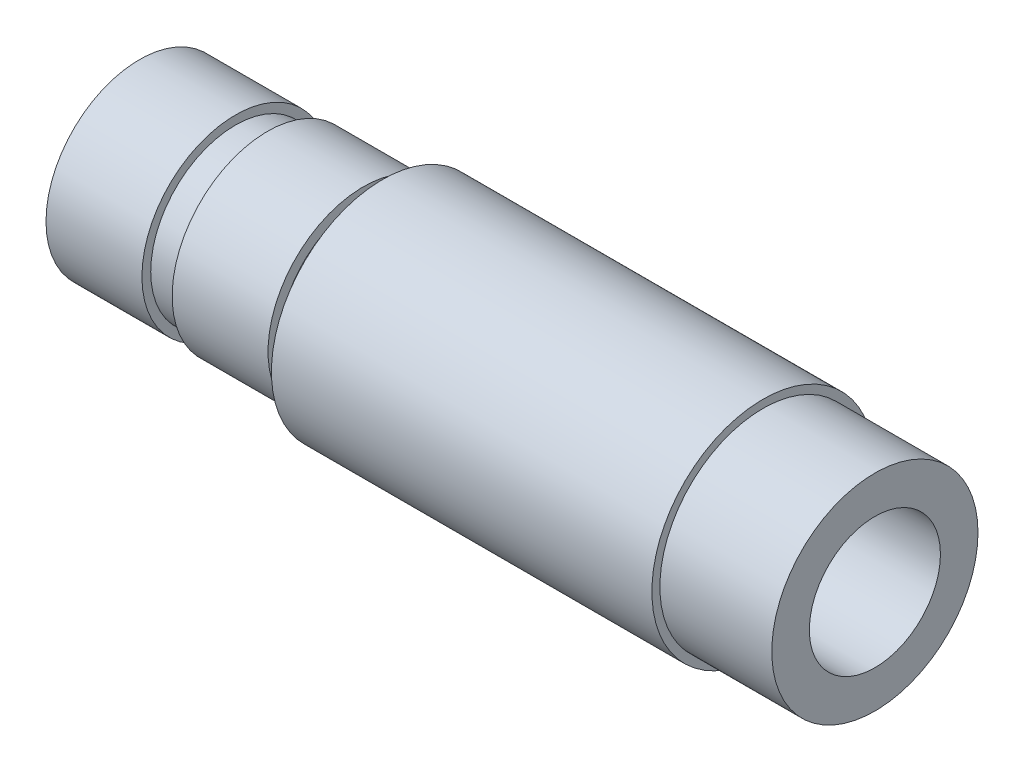
ISO-10303-21;
HEADER;
FILE_DESCRIPTION(('STEP AP214'),'2;1');
FILE_NAME('part.step','',(''),(''),'','','');
FILE_SCHEMA(('AUTOMOTIVE_DESIGN { 1 0 10303 214 1 1 1 1 }'));
ENDSEC;
DATA;
#1=APPLICATION_CONTEXT('core data for automotive mechanical design processes');
#2=APPLICATION_PROTOCOL_DEFINITION('international standard','automotive_design',2000,#1);
#3=PRODUCT_CONTEXT('',#1,'mechanical');
#4=PRODUCT('Part','Part','',(#3));
#5=PRODUCT_RELATED_PRODUCT_CATEGORY('part','',(#4));
#6=PRODUCT_DEFINITION_FORMATION('','',#4);
#7=PRODUCT_DEFINITION_CONTEXT('part definition',#1,'design');
#8=PRODUCT_DEFINITION('design','',#6,#7);
#9=PRODUCT_DEFINITION_SHAPE('','',#8);
#10=(LENGTH_UNIT() NAMED_UNIT(*) SI_UNIT(.MILLI.,.METRE.));
#11=(NAMED_UNIT(*) PLANE_ANGLE_UNIT() SI_UNIT($,.RADIAN.));
#12=(NAMED_UNIT(*) SI_UNIT($,.STERADIAN.) SOLID_ANGLE_UNIT());
#13=UNCERTAINTY_MEASURE_WITH_UNIT(LENGTH_MEASURE(1.E-05),#10,'distance_accuracy_value','');
#14=(GEOMETRIC_REPRESENTATION_CONTEXT(3) GLOBAL_UNCERTAINTY_ASSIGNED_CONTEXT((#13)) GLOBAL_UNIT_ASSIGNED_CONTEXT((#10,
#11,#12)) REPRESENTATION_CONTEXT('',''));
#15=CARTESIAN_POINT('',(0.,0.,0.));
#16=DIRECTION('',(0.,0.,1.));
#17=DIRECTION('',(1.,0.,0.));
#18=AXIS2_PLACEMENT_3D('',#15,#16,#17);
#19=CARTESIAN_POINT('',(284.762244726479,0.,0.));
#20=DIRECTION('',(1.,0.,0.));
#21=DIRECTION('',(0.,0.,-1.));
#22=AXIS2_PLACEMENT_3D('',#19,#20,#21);
#23=PLANE('',#22);
#24=CARTESIAN_POINT('',(284.762244726479,76.8438535300278,0.));
#25=DIRECTION('',(-1.,0.,0.));
#26=DIRECTION('',(0.,0.,1.));
#27=AXIS2_PLACEMENT_3D('',#24,#25,#26);
#28=CIRCLE('',#27,1.75);
#29=CARTESIAN_POINT('',(284.762244726479,76.8438535300278,1.75));
#30=VERTEX_POINT('',#29);
#31=EDGE_CURVE('E82',#30,#30,#28,.T.);
#32=ORIENTED_EDGE('',*,*,#31,.F.);
#33=EDGE_LOOP('',(#32));
#34=FACE_BOUND('',#33,.T.);
#35=CARTESIAN_POINT('',(284.762244726479,76.8438535300278,0.));
#36=DIRECTION('',(1.,0.,0.));
#37=DIRECTION('',(0.,0.,-1.));
#38=AXIS2_PLACEMENT_3D('',#35,#36,#37);
#39=CIRCLE('',#38,2.925);
#40=CARTESIAN_POINT('',(284.762244726479,76.8438535300278,-2.925));
#41=VERTEX_POINT('',#40);
#42=EDGE_CURVE('E64',#41,#41,#39,.T.);
#43=ORIENTED_EDGE('',*,*,#42,.F.);
#44=EDGE_LOOP('',(#43));
#45=FACE_BOUND('',#44,.T.);
#46=ADVANCED_FACE('F32',(#34,#45),#23,.F.);
#47=CARTESIAN_POINT('',(307.762244726479,76.8438535300278,0.));
#48=DIRECTION('',(1.,0.,0.));
#49=DIRECTION('',(0.,0.,-1.));
#50=AXIS2_PLACEMENT_3D('',#47,#48,#49);
#51=CYLINDRICAL_SURFACE('',#50,2.925);
#52=CARTESIAN_POINT('',(287.762244726479,76.8438535300278,0.));
#53=DIRECTION('',(1.,0.,0.));
#54=DIRECTION('',(0.,0.,-1.));
#55=AXIS2_PLACEMENT_3D('',#52,#53,#54);
#56=CIRCLE('',#55,2.925);
#57=CARTESIAN_POINT('',(287.762244726479,76.8438535300278,-2.925));
#58=VERTEX_POINT('',#57);
#59=EDGE_CURVE('E61',#58,#58,#56,.T.);
#60=ORIENTED_EDGE('',*,*,#59,.F.);
#61=EDGE_LOOP('',(#60));
#62=FACE_BOUND('',#61,.T.);
#63=ORIENTED_EDGE('',*,*,#42,.T.);
#64=EDGE_LOOP('',(#63));
#65=FACE_BOUND('',#64,.T.);
#66=ADVANCED_FACE('F122',(#62,#65),#51,.T.);
#67=CARTESIAN_POINT('',(287.762244726479,0.,0.));
#68=DIRECTION('',(-1.,0.,0.));
#69=DIRECTION('',(0.,0.,1.));
#70=AXIS2_PLACEMENT_3D('',#67,#68,#69);
#71=PLANE('',#70);
#72=CARTESIAN_POINT('',(287.762244726479,76.8438535300278,0.));
#73=DIRECTION('',(1.,0.,0.));
#74=DIRECTION('',(0.,0.,-1.));
#75=AXIS2_PLACEMENT_3D('',#72,#73,#74);
#76=CIRCLE('',#75,2.65);
#77=CARTESIAN_POINT('',(287.762244726479,76.8438535300278,-2.65));
#78=VERTEX_POINT('',#77);
#79=EDGE_CURVE('E58',#78,#78,#76,.T.);
#80=ORIENTED_EDGE('',*,*,#79,.F.);
#81=EDGE_LOOP('',(#80));
#82=FACE_BOUND('',#81,.T.);
#83=ORIENTED_EDGE('',*,*,#59,.T.);
#84=EDGE_LOOP('',(#83));
#85=FACE_BOUND('',#84,.T.);
#86=ADVANCED_FACE('F126',(#82,#85),#71,.F.);
#87=CARTESIAN_POINT('',(307.762244726479,76.8438535300278,0.));
#88=DIRECTION('',(1.,0.,0.));
#89=DIRECTION('',(0.,0.,-1.));
#90=AXIS2_PLACEMENT_3D('',#87,#88,#89);
#91=CYLINDRICAL_SURFACE('',#90,2.65);
#92=CARTESIAN_POINT('',(288.762244726479,76.8438535300278,0.));
#93=DIRECTION('',(1.,0.,0.));
#94=DIRECTION('',(0.,0.,-1.));
#95=AXIS2_PLACEMENT_3D('',#92,#93,#94);
#96=CIRCLE('',#95,2.65);
#97=CARTESIAN_POINT('',(288.762244726479,76.8438535300278,-2.65));
#98=VERTEX_POINT('',#97);
#99=EDGE_CURVE('E55',#98,#98,#96,.T.);
#100=ORIENTED_EDGE('',*,*,#99,.F.);
#101=EDGE_LOOP('',(#100));
#102=FACE_BOUND('',#101,.T.);
#103=ORIENTED_EDGE('',*,*,#79,.T.);
#104=EDGE_LOOP('',(#103));
#105=FACE_BOUND('',#104,.T.);
#106=ADVANCED_FACE('F132',(#102,#105),#91,.T.);
#107=CARTESIAN_POINT('',(288.762244726479,0.,0.));
#108=DIRECTION('',(1.,0.,0.));
#109=DIRECTION('',(0.,0.,-1.));
#110=AXIS2_PLACEMENT_3D('',#107,#108,#109);
#111=PLANE('',#110);
#112=CARTESIAN_POINT('',(288.762244726479,76.8438535300278,0.));
#113=DIRECTION('',(1.,0.,0.));
#114=DIRECTION('',(0.,0.,-1.));
#115=AXIS2_PLACEMENT_3D('',#112,#113,#114);
#116=CIRCLE('',#115,2.98);
#117=CARTESIAN_POINT('',(288.762244726479,76.8438535300278,-2.98));
#118=VERTEX_POINT('',#117);
#119=EDGE_CURVE('E52',#118,#118,#116,.T.);
#120=ORIENTED_EDGE('',*,*,#119,.F.);
#121=EDGE_LOOP('',(#120));
#122=FACE_BOUND('',#121,.T.);
#123=ORIENTED_EDGE('',*,*,#99,.T.);
#124=EDGE_LOOP('',(#123));
#125=FACE_BOUND('',#124,.T.);
#126=ADVANCED_FACE('F136',(#122,#125),#111,.F.);
#127=CARTESIAN_POINT('',(307.762244726479,76.8438535300278,0.));
#128=DIRECTION('',(1.,0.,0.));
#129=DIRECTION('',(0.,0.,-1.));
#130=AXIS2_PLACEMENT_3D('',#127,#128,#129);
#131=CYLINDRICAL_SURFACE('',#130,2.98);
#132=CARTESIAN_POINT('',(291.762244726479,76.8438535300278,0.));
#133=DIRECTION('',(1.,0.,0.));
#134=DIRECTION('',(0.,0.,-1.));
#135=AXIS2_PLACEMENT_3D('',#132,#133,#134);
#136=CIRCLE('',#135,2.98);
#137=CARTESIAN_POINT('',(291.762244726479,76.8438535300278,-2.98));
#138=VERTEX_POINT('',#137);
#139=EDGE_CURVE('E49',#138,#138,#136,.T.);
#140=ORIENTED_EDGE('',*,*,#139,.F.);
#141=EDGE_LOOP('',(#140));
#142=FACE_BOUND('',#141,.T.);
#143=ORIENTED_EDGE('',*,*,#119,.T.);
#144=EDGE_LOOP('',(#143));
#145=FACE_BOUND('',#144,.T.);
#146=ADVANCED_FACE('F140',(#142,#145),#131,.T.);
#147=CARTESIAN_POINT('',(291.762244726479,0.,0.));
#148=DIRECTION('',(-1.,0.,0.));
#149=DIRECTION('',(0.,0.,1.));
#150=AXIS2_PLACEMENT_3D('',#147,#148,#149);
#151=PLANE('',#150);
#152=CARTESIAN_POINT('',(291.762244726479,76.8438535300278,0.));
#153=DIRECTION('',(1.,0.,0.));
#154=DIRECTION('',(0.,0.,-1.));
#155=AXIS2_PLACEMENT_3D('',#152,#153,#154);
#156=CIRCLE('',#155,2.65);
#157=CARTESIAN_POINT('',(291.762244726479,76.8438535300278,-2.65));
#158=VERTEX_POINT('',#157);
#159=EDGE_CURVE('E44',#158,#158,#156,.T.);
#160=ORIENTED_EDGE('',*,*,#159,.F.);
#161=EDGE_LOOP('',(#160));
#162=FACE_BOUND('',#161,.T.);
#163=ORIENTED_EDGE('',*,*,#139,.T.);
#164=EDGE_LOOP('',(#163));
#165=FACE_BOUND('',#164,.T.);
#166=ADVANCED_FACE('F144',(#162,#165),#151,.F.);
#167=CARTESIAN_POINT('',(307.762244726479,76.8438535300278,0.));
#168=DIRECTION('',(1.,0.,0.));
#169=DIRECTION('',(0.,0.,-1.));
#170=AXIS2_PLACEMENT_3D('',#167,#168,#169);
#171=CYLINDRICAL_SURFACE('',#170,2.65);
#172=CARTESIAN_POINT('',(292.362244726479,76.8438535300278,0.));
#173=DIRECTION('',(1.,0.,0.));
#174=DIRECTION('',(0.,0.,-1.));
#175=AXIS2_PLACEMENT_3D('',#172,#173,#174);
#176=CIRCLE('',#175,2.65);
#177=CARTESIAN_POINT('',(292.362244726479,76.8438535300278,-2.65));
#178=VERTEX_POINT('',#177);
#179=EDGE_CURVE('E40',#178,#178,#176,.T.);
#180=ORIENTED_EDGE('',*,*,#179,.F.);
#181=EDGE_LOOP('',(#180));
#182=FACE_BOUND('',#181,.T.);
#183=ORIENTED_EDGE('',*,*,#159,.T.);
#184=EDGE_LOOP('',(#183));
#185=FACE_BOUND('',#184,.T.);
#186=ADVANCED_FACE('F148',(#182,#185),#171,.T.);
#187=CARTESIAN_POINT('',(292.362244726479,0.,0.));
#188=DIRECTION('',(1.,0.,0.));
#189=DIRECTION('',(0.,0.,-1.));
#190=AXIS2_PLACEMENT_3D('',#187,#188,#189);
#191=PLANE('',#190);
#192=CARTESIAN_POINT('',(292.362244726479,76.8438535300278,0.));
#193=DIRECTION('',(1.,0.,0.));
#194=DIRECTION('',(0.,0.,-1.));
#195=AXIS2_PLACEMENT_3D('',#192,#193,#194);
#196=CIRCLE('',#195,3.47500000000001);
#197=CARTESIAN_POINT('',(292.362244726479,76.8438535300278,-3.47500000000001));
#198=VERTEX_POINT('',#197);
#199=EDGE_CURVE('E10',#198,#198,#196,.T.);
#200=ORIENTED_EDGE('',*,*,#199,.F.);
#201=EDGE_LOOP('',(#200));
#202=FACE_BOUND('',#201,.T.);
#203=ORIENTED_EDGE('',*,*,#179,.T.);
#204=EDGE_LOOP('',(#203));
#205=FACE_BOUND('',#204,.T.);
#206=ADVANCED_FACE('F112',(#202,#205),#191,.F.);
#207=CARTESIAN_POINT('',(304.262244726479,0.,0.));
#208=DIRECTION('',(-1.,0.,0.));
#209=DIRECTION('',(0.,0.,1.));
#210=AXIS2_PLACEMENT_3D('',#207,#208,#209);
#211=PLANE('',#210);
#212=CARTESIAN_POINT('',(304.262244726479,76.8438535300278,0.));
#213=DIRECTION('',(1.,0.,0.));
#214=DIRECTION('',(0.,0.,-1.));
#215=AXIS2_PLACEMENT_3D('',#212,#213,#214);
#216=CIRCLE('',#215,3.22500000000001);
#217=CARTESIAN_POINT('',(304.262244726479,76.8438535300278,-3.22500000000001));
#218=VERTEX_POINT('',#217);
#219=EDGE_CURVE('E70',#218,#218,#216,.T.);
#220=ORIENTED_EDGE('',*,*,#219,.F.);
#221=EDGE_LOOP('',(#220));
#222=FACE_BOUND('',#221,.T.);
#223=CARTESIAN_POINT('',(304.262244726479,76.8438535300278,0.));
#224=DIRECTION('',(1.,0.,0.));
#225=DIRECTION('',(0.,0.,-1.));
#226=AXIS2_PLACEMENT_3D('',#223,#224,#225);
#227=CIRCLE('',#226,3.47500000000001);
#228=CARTESIAN_POINT('',(304.262244726479,76.8438535300278,-3.47500000000001));
#229=VERTEX_POINT('',#228);
#230=EDGE_CURVE('E73',#229,#229,#227,.T.);
#231=ORIENTED_EDGE('',*,*,#230,.T.);
#232=EDGE_LOOP('',(#231));
#233=FACE_BOUND('',#232,.T.);
#234=ADVANCED_FACE('F103',(#222,#233),#211,.F.);
#235=CARTESIAN_POINT('',(307.762244726479,76.8438535300278,0.));
#236=DIRECTION('',(1.,0.,0.));
#237=DIRECTION('',(0.,0.,-1.));
#238=AXIS2_PLACEMENT_3D('',#235,#236,#237);
#239=CYLINDRICAL_SURFACE('',#238,3.22500000000001);
#240=CARTESIAN_POINT('',(307.762244726479,76.8438535300278,0.));
#241=DIRECTION('',(1.,0.,0.));
#242=DIRECTION('',(0.,0.,-1.));
#243=AXIS2_PLACEMENT_3D('',#240,#241,#242);
#244=CIRCLE('',#243,3.22500000000001);
#245=CARTESIAN_POINT('',(307.762244726479,76.8438535300278,-3.22500000000001));
#246=VERTEX_POINT('',#245);
#247=EDGE_CURVE('E67',#246,#246,#244,.T.);
#248=ORIENTED_EDGE('',*,*,#247,.F.);
#249=EDGE_LOOP('',(#248));
#250=FACE_BOUND('',#249,.T.);
#251=ORIENTED_EDGE('',*,*,#219,.T.);
#252=EDGE_LOOP('',(#251));
#253=FACE_BOUND('',#252,.T.);
#254=ADVANCED_FACE('F101',(#250,#253),#239,.T.);
#255=CARTESIAN_POINT('',(307.762244726479,76.8438535300278,0.));
#256=DIRECTION('',(1.,0.,0.));
#257=DIRECTION('',(0.,0.,-1.));
#258=AXIS2_PLACEMENT_3D('',#255,#256,#257);
#259=CYLINDRICAL_SURFACE('',#258,3.47500000000001);
#260=ORIENTED_EDGE('',*,*,#230,.F.);
#261=EDGE_LOOP('',(#260));
#262=FACE_BOUND('',#261,.T.);
#263=ORIENTED_EDGE('',*,*,#199,.T.);
#264=EDGE_LOOP('',(#263));
#265=FACE_BOUND('',#264,.T.);
#266=ADVANCED_FACE('F34',(#262,#265),#259,.T.);
#267=CARTESIAN_POINT('',(307.762244726479,0.,0.));
#268=DIRECTION('',(1.,0.,0.));
#269=DIRECTION('',(0.,0.,-1.));
#270=AXIS2_PLACEMENT_3D('',#267,#268,#269);
#271=PLANE('',#270);
#272=CARTESIAN_POINT('',(307.762244726479,76.8438535300278,0.));
#273=DIRECTION('',(1.,0.,0.));
#274=DIRECTION('',(0.,0.,-1.));
#275=AXIS2_PLACEMENT_3D('',#272,#273,#274);
#276=CIRCLE('',#275,2.05);
#277=CARTESIAN_POINT('',(307.762244726479,76.8438535300278,-2.05));
#278=VERTEX_POINT('',#277);
#279=EDGE_CURVE('E79',#278,#278,#276,.T.);
#280=ORIENTED_EDGE('',*,*,#279,.F.);
#281=EDGE_LOOP('',(#280));
#282=FACE_BOUND('',#281,.T.);
#283=ORIENTED_EDGE('',*,*,#247,.T.);
#284=EDGE_LOOP('',(#283));
#285=FACE_BOUND('',#284,.T.);
#286=ADVANCED_FACE('F110',(#282,#285),#271,.T.);
#287=CARTESIAN_POINT('',(302.262244726479,76.8438535300278,0.));
#288=DIRECTION('',(1.,0.,0.));
#289=DIRECTION('',(0.,0.,-1.));
#290=AXIS2_PLACEMENT_3D('',#287,#288,#289);
#291=CONICAL_SURFACE('',#290,2.05,1.02974425867665);
#292=CARTESIAN_POINT('',(302.08198654077,76.8438535300278,0.));
#293=DIRECTION('',(1.,0.,0.));
#294=DIRECTION('',(0.,0.,-1.));
#295=AXIS2_PLACEMENT_3D('',#292,#293,#294);
#296=CIRCLE('',#295,1.75);
#297=CARTESIAN_POINT('',(302.08198654077,76.8438535300278,-1.75));
#298=VERTEX_POINT('',#297);
#299=EDGE_CURVE('E36',#298,#298,#296,.F.);
#300=ORIENTED_EDGE('',*,*,#299,.T.);
#301=EDGE_LOOP('',(#300));
#302=FACE_BOUND('',#301,.T.);
#303=CARTESIAN_POINT('',(302.262244726479,76.8438535300278,0.));
#304=DIRECTION('',(1.,0.,0.));
#305=DIRECTION('',(0.,0.,-1.));
#306=AXIS2_PLACEMENT_3D('',#303,#304,#305);
#307=CIRCLE('',#306,2.05);
#308=CARTESIAN_POINT('',(302.262244726479,76.8438535300278,-2.05));
#309=VERTEX_POINT('',#308);
#310=EDGE_CURVE('E76',#309,#309,#307,.T.);
#311=ORIENTED_EDGE('',*,*,#310,.T.);
#312=EDGE_LOOP('',(#311));
#313=FACE_BOUND('',#312,.T.);
#314=ADVANCED_FACE('F89',(#302,#313),#291,.F.);
#315=CARTESIAN_POINT('',(307.762244726479,76.8438535300278,0.));
#316=DIRECTION('',(1.,0.,0.));
#317=DIRECTION('',(0.,0.,-1.));
#318=AXIS2_PLACEMENT_3D('',#315,#316,#317);
#319=CYLINDRICAL_SURFACE('',#318,2.05);
#320=ORIENTED_EDGE('',*,*,#310,.F.);
#321=EDGE_LOOP('',(#320));
#322=FACE_BOUND('',#321,.T.);
#323=ORIENTED_EDGE('',*,*,#279,.T.);
#324=EDGE_LOOP('',(#323));
#325=FACE_BOUND('',#324,.T.);
#326=ADVANCED_FACE('F94',(#322,#325),#319,.F.);
#327=CARTESIAN_POINT('',(314.562244726479,76.8438535300278,0.));
#328=DIRECTION('',(-1.,0.,0.));
#329=DIRECTION('',(0.,0.,1.));
#330=AXIS2_PLACEMENT_3D('',#327,#328,#329);
#331=CYLINDRICAL_SURFACE('',#330,1.75);
#332=ORIENTED_EDGE('',*,*,#31,.T.);
#333=EDGE_LOOP('',(#332));
#334=FACE_BOUND('',#333,.T.);
#335=ORIENTED_EDGE('',*,*,#299,.F.);
#336=EDGE_LOOP('',(#335));
#337=FACE_BOUND('',#336,.T.);
#338=ADVANCED_FACE('F92',(#334,#337),#331,.F.);
#339=CLOSED_SHELL('',(#46,#66,#86,#106,#126,#146,#166,#186,#206,#234,#254,#266,#286,#314,#326,#338));
#340=MANIFOLD_SOLID_BREP('B2',#339);
#341=ADVANCED_BREP_SHAPE_REPRESENTATION('',(#18,#340),#14);
#342=SHAPE_DEFINITION_REPRESENTATION(#9,#341);
ENDSEC;
END-ISO-10303-21;
